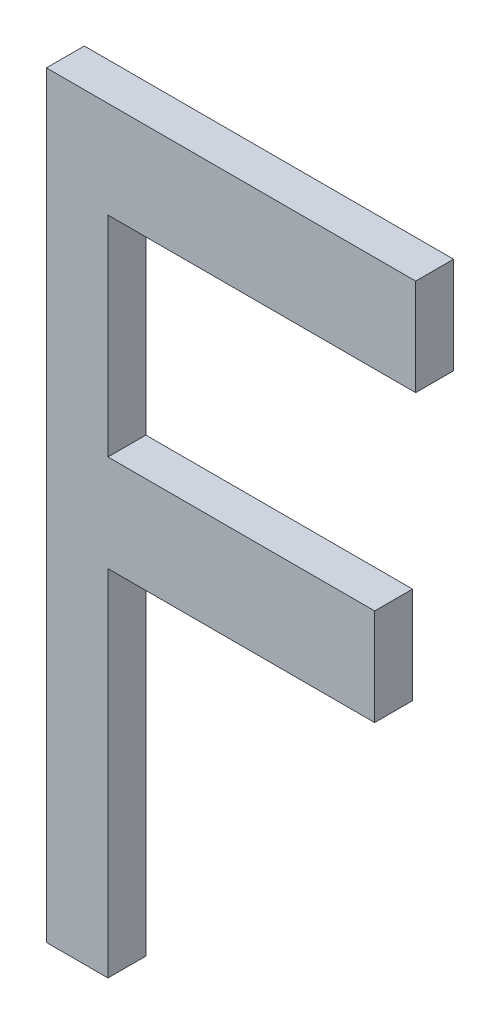
ISO-10303-21;
HEADER;
FILE_DESCRIPTION(('STEP AP214'),'2;1');
FILE_NAME('part.step','',(''),(''),'','','');
FILE_SCHEMA(('AUTOMOTIVE_DESIGN { 1 0 10303 214 1 1 1 1 }'));
ENDSEC;
DATA;
#1=APPLICATION_CONTEXT('core data for automotive mechanical design processes');
#2=APPLICATION_PROTOCOL_DEFINITION('international standard','automotive_design',2000,#1);
#3=PRODUCT_CONTEXT('',#1,'mechanical');
#4=PRODUCT('Part','Part','',(#3));
#5=PRODUCT_RELATED_PRODUCT_CATEGORY('part','',(#4));
#6=PRODUCT_DEFINITION_FORMATION('','',#4);
#7=PRODUCT_DEFINITION_CONTEXT('part definition',#1,'design');
#8=PRODUCT_DEFINITION('design','',#6,#7);
#9=PRODUCT_DEFINITION_SHAPE('','',#8);
#10=(LENGTH_UNIT() NAMED_UNIT(*) SI_UNIT(.MILLI.,.METRE.));
#11=(NAMED_UNIT(*) PLANE_ANGLE_UNIT() SI_UNIT($,.RADIAN.));
#12=(NAMED_UNIT(*) SI_UNIT($,.STERADIAN.) SOLID_ANGLE_UNIT());
#13=UNCERTAINTY_MEASURE_WITH_UNIT(LENGTH_MEASURE(1.E-05),#10,'distance_accuracy_value','');
#14=(GEOMETRIC_REPRESENTATION_CONTEXT(3) GLOBAL_UNCERTAINTY_ASSIGNED_CONTEXT((#13)) GLOBAL_UNIT_ASSIGNED_CONTEXT((#10,
#11,#12)) REPRESENTATION_CONTEXT('',''));
#15=CARTESIAN_POINT('',(0.,0.,0.));
#16=DIRECTION('',(0.,0.,1.));
#17=DIRECTION('',(1.,0.,0.));
#18=AXIS2_PLACEMENT_3D('',#15,#16,#17);
#19=CARTESIAN_POINT('',(71.1648311134674,28.2906710184784,5.9));
#20=DIRECTION('',(0.,0.,1.));
#21=DIRECTION('',(1.,0.,0.));
#22=AXIS2_PLACEMENT_3D('',#19,#20,#21);
#23=PLANE('',#22);
#24=DIRECTION('',(1.,0.,0.));
#25=VECTOR('',#24,1.);
#26=CARTESIAN_POINT('',(71.1648311134674,30.2906710184783,5.9));
#27=LINE('',#26,#25);
#28=CARTESIAN_POINT('',(72.1398311134674,30.2906710184783,5.9));
#29=VERTEX_POINT('',#28);
#30=CARTESIAN_POINT('',(71.1648311134674,30.2906710184783,5.9));
#31=VERTEX_POINT('',#30);
#32=EDGE_CURVE('E126',#29,#31,#27,.F.);
#33=ORIENTED_EDGE('',*,*,#32,.F.);
#34=DIRECTION('',(0.,1.,0.));
#35=VECTOR('',#34,1.);
#36=CARTESIAN_POINT('',(72.1398311134674,28.2906710184784,5.9));
#37=LINE('',#36,#35);
#38=CARTESIAN_POINT('',(72.1398311134674,30.0353518999784,5.9));
#39=VERTEX_POINT('',#38);
#40=EDGE_CURVE('E124',#39,#29,#37,.T.);
#41=ORIENTED_EDGE('',*,*,#40,.F.);
#42=DIRECTION('',(1.,0.,0.));
#43=VECTOR('',#42,1.);
#44=CARTESIAN_POINT('',(71.1648311134674,30.0353518999784,5.9));
#45=LINE('',#44,#43);
#46=CARTESIAN_POINT('',(71.3273311134674,30.0353518999784,5.9));
#47=VERTEX_POINT('',#46);
#48=EDGE_CURVE('E122',#47,#39,#45,.T.);
#49=ORIENTED_EDGE('',*,*,#48,.F.);
#50=DIRECTION('',(0.,1.,0.));
#51=VECTOR('',#50,1.);
#52=CARTESIAN_POINT('',(71.3273311134674,28.2906710184784,5.9));
#53=LINE('',#52,#51);
#54=CARTESIAN_POINT('',(71.3273311134674,29.4821603573583,5.9));
#55=VERTEX_POINT('',#54);
#56=EDGE_CURVE('E120',#55,#47,#53,.T.);
#57=ORIENTED_EDGE('',*,*,#56,.F.);
#58=DIRECTION('',(1.,0.,0.));
#59=VECTOR('',#58,1.);
#60=CARTESIAN_POINT('',(71.1648311134674,29.4821603573584,5.9));
#61=LINE('',#60,#59);
#62=CARTESIAN_POINT('',(72.0314978059574,29.4821603573584,5.9));
#63=VERTEX_POINT('',#62);
#64=EDGE_CURVE('E118',#63,#55,#61,.F.);
#65=ORIENTED_EDGE('',*,*,#64,.F.);
#66=DIRECTION('',(0.,1.,0.));
#67=VECTOR('',#66,1.);
#68=CARTESIAN_POINT('',(72.0314978059574,28.2906710184784,5.9));
#69=LINE('',#68,#67);
#70=CARTESIAN_POINT('',(72.0314978059574,29.2268412388584,5.9));
#71=VERTEX_POINT('',#70);
#72=EDGE_CURVE('E114',#71,#63,#69,.T.);
#73=ORIENTED_EDGE('',*,*,#72,.F.);
#74=DIRECTION('',(1.,0.,0.));
#75=VECTOR('',#74,1.);
#76=CARTESIAN_POINT('',(71.1648311134674,29.2268412388584,5.9));
#77=LINE('',#76,#75);
#78=CARTESIAN_POINT('',(71.3273311134674,29.2268412388584,5.9));
#79=VERTEX_POINT('',#78);
#80=EDGE_CURVE('E113',#79,#71,#77,.T.);
#81=ORIENTED_EDGE('',*,*,#80,.F.);
#82=DIRECTION('',(0.,1.,0.));
#83=VECTOR('',#82,1.);
#84=CARTESIAN_POINT('',(71.3273311134674,28.2906710184784,5.9));
#85=LINE('',#84,#83);
#86=CARTESIAN_POINT('',(71.3273311134674,28.2906710184784,5.9));
#87=VERTEX_POINT('',#86);
#88=EDGE_CURVE('E91',#87,#79,#85,.T.);
#89=ORIENTED_EDGE('',*,*,#88,.F.);
#90=DIRECTION('',(1.,0.,0.));
#91=VECTOR('',#90,1.);
#92=CARTESIAN_POINT('',(71.1648311134674,28.2906710184784,5.9));
#93=LINE('',#92,#91);
#94=CARTESIAN_POINT('',(71.1648311134674,28.2906710184784,5.9));
#95=VERTEX_POINT('',#94);
#96=EDGE_CURVE('E20',#95,#87,#93,.T.);
#97=ORIENTED_EDGE('',*,*,#96,.F.);
#98=DIRECTION('',(0.,1.,0.));
#99=VECTOR('',#98,1.);
#100=CARTESIAN_POINT('',(71.1648311134674,30.2906710184784,5.9));
#101=LINE('',#100,#99);
#102=EDGE_CURVE('E128',#95,#31,#101,.T.);
#103=ORIENTED_EDGE('',*,*,#102,.T.);
#104=EDGE_LOOP('',(#33,#41,#49,#57,#65,#73,#81,#89,#97,#103));
#105=FACE_BOUND('',#104,.T.);
#106=ADVANCED_FACE('F17',(#105),#23,.F.);
#107=CARTESIAN_POINT('',(71.1648311134674,30.2906710184784,6.));
#108=DIRECTION('',(1.,0.,0.));
#109=DIRECTION('',(0.,0.,-1.));
#110=AXIS2_PLACEMENT_3D('',#107,#108,#109);
#111=PLANE('',#110);
#112=DIRECTION('',(0.,0.,1.));
#113=VECTOR('',#112,1.);
#114=CARTESIAN_POINT('',(71.1648311134674,28.2906710184784,6.));
#115=LINE('',#114,#113);
#116=CARTESIAN_POINT('',(71.1648311134674,28.2906710184784,6.));
#117=VERTEX_POINT('',#116);
#118=EDGE_CURVE('E100',#95,#117,#115,.T.);
#119=ORIENTED_EDGE('',*,*,#118,.T.);
#120=DIRECTION('',(0.,1.,0.));
#121=VECTOR('',#120,1.);
#122=CARTESIAN_POINT('',(71.1648311134674,28.2906710184784,6.));
#123=LINE('',#122,#121);
#124=CARTESIAN_POINT('',(71.1648311134674,30.2906710184784,6.));
#125=VERTEX_POINT('',#124);
#126=EDGE_CURVE('E146',#125,#117,#123,.F.);
#127=ORIENTED_EDGE('',*,*,#126,.F.);
#128=DIRECTION('',(0.,0.,1.));
#129=VECTOR('',#128,1.);
#130=CARTESIAN_POINT('',(71.1648311134674,30.2906710184783,6.));
#131=LINE('',#130,#129);
#132=EDGE_CURVE('E143',#125,#31,#131,.F.);
#133=ORIENTED_EDGE('',*,*,#132,.T.);
#134=ORIENTED_EDGE('',*,*,#102,.F.);
#135=EDGE_LOOP('',(#119,#127,#133,#134));
#136=FACE_BOUND('',#135,.T.);
#137=ADVANCED_FACE('F181',(#136),#111,.F.);
#138=CARTESIAN_POINT('',(71.1648311134674,28.2906710184784,6.));
#139=DIRECTION('',(0.,1.,0.));
#140=DIRECTION('',(0.,0.,1.));
#141=AXIS2_PLACEMENT_3D('',#138,#139,#140);
#142=PLANE('',#141);
#143=DIRECTION('',(0.,0.,1.));
#144=VECTOR('',#143,1.);
#145=CARTESIAN_POINT('',(71.3273311134674,28.2906710184784,6.));
#146=LINE('',#145,#144);
#147=CARTESIAN_POINT('',(71.3273311134674,28.2906710184784,6.));
#148=VERTEX_POINT('',#147);
#149=EDGE_CURVE('E98',#87,#148,#146,.T.);
#150=ORIENTED_EDGE('',*,*,#149,.T.);
#151=DIRECTION('',(1.,0.,0.));
#152=VECTOR('',#151,1.);
#153=CARTESIAN_POINT('',(71.1648311134674,28.2906710184784,6.));
#154=LINE('',#153,#152);
#155=EDGE_CURVE('E149',#117,#148,#154,.T.);
#156=ORIENTED_EDGE('',*,*,#155,.F.);
#157=ORIENTED_EDGE('',*,*,#118,.F.);
#158=ORIENTED_EDGE('',*,*,#96,.T.);
#159=EDGE_LOOP('',(#150,#156,#157,#158));
#160=FACE_BOUND('',#159,.T.);
#161=ADVANCED_FACE('F96',(#160),#142,.F.);
#162=CARTESIAN_POINT('',(71.3273311134674,28.2906710184784,6.));
#163=DIRECTION('',(-1.,0.,0.));
#164=DIRECTION('',(0.,0.,1.));
#165=AXIS2_PLACEMENT_3D('',#162,#163,#164);
#166=PLANE('',#165);
#167=DIRECTION('',(0.,0.,1.));
#168=VECTOR('',#167,1.);
#169=CARTESIAN_POINT('',(71.3273311134674,29.2268412388584,6.));
#170=LINE('',#169,#168);
#171=CARTESIAN_POINT('',(71.3273311134674,29.2268412388584,6.));
#172=VERTEX_POINT('',#171);
#173=EDGE_CURVE('E108',#79,#172,#170,.T.);
#174=ORIENTED_EDGE('',*,*,#173,.T.);
#175=DIRECTION('',(0.,1.,0.));
#176=VECTOR('',#175,1.);
#177=CARTESIAN_POINT('',(71.3273311134674,28.2906710184784,6.));
#178=LINE('',#177,#176);
#179=EDGE_CURVE('E106',#148,#172,#178,.T.);
#180=ORIENTED_EDGE('',*,*,#179,.F.);
#181=ORIENTED_EDGE('',*,*,#149,.F.);
#182=ORIENTED_EDGE('',*,*,#88,.T.);
#183=EDGE_LOOP('',(#174,#180,#181,#182));
#184=FACE_BOUND('',#183,.T.);
#185=ADVANCED_FACE('F104',(#184),#166,.F.);
#186=CARTESIAN_POINT('',(71.3273311134674,29.2268412388584,6.));
#187=DIRECTION('',(0.,1.,0.));
#188=DIRECTION('',(0.,0.,1.));
#189=AXIS2_PLACEMENT_3D('',#186,#187,#188);
#190=PLANE('',#189);
#191=DIRECTION('',(0.,0.,1.));
#192=VECTOR('',#191,1.);
#193=CARTESIAN_POINT('',(72.0314978059574,29.2268412388584,6.));
#194=LINE('',#193,#192);
#195=CARTESIAN_POINT('',(72.0314978059574,29.2268412388584,6.));
#196=VERTEX_POINT('',#195);
#197=EDGE_CURVE('E132',#71,#196,#194,.T.);
#198=ORIENTED_EDGE('',*,*,#197,.T.);
#199=DIRECTION('',(1.,0.,0.));
#200=VECTOR('',#199,1.);
#201=CARTESIAN_POINT('',(71.1648311134674,29.2268412388584,6.));
#202=LINE('',#201,#200);
#203=EDGE_CURVE('E152',#172,#196,#202,.T.);
#204=ORIENTED_EDGE('',*,*,#203,.F.);
#205=ORIENTED_EDGE('',*,*,#173,.F.);
#206=ORIENTED_EDGE('',*,*,#80,.T.);
#207=EDGE_LOOP('',(#198,#204,#205,#206));
#208=FACE_BOUND('',#207,.T.);
#209=ADVANCED_FACE('F185',(#208),#190,.F.);
#210=CARTESIAN_POINT('',(72.0314978059574,29.2268412388584,6.));
#211=DIRECTION('',(-1.,0.,0.));
#212=DIRECTION('',(0.,0.,1.));
#213=AXIS2_PLACEMENT_3D('',#210,#211,#212);
#214=PLANE('',#213);
#215=DIRECTION('',(0.,0.,-1.));
#216=VECTOR('',#215,1.);
#217=CARTESIAN_POINT('',(72.0314978059574,29.4821603573583,6.));
#218=LINE('',#217,#216);
#219=CARTESIAN_POINT('',(72.0314978059574,29.4821603573584,6.));
#220=VERTEX_POINT('',#219);
#221=EDGE_CURVE('E134',#63,#220,#218,.F.);
#222=ORIENTED_EDGE('',*,*,#221,.T.);
#223=DIRECTION('',(0.,1.,0.));
#224=VECTOR('',#223,1.);
#225=CARTESIAN_POINT('',(72.0314978059574,28.2906710184784,6.));
#226=LINE('',#225,#224);
#227=EDGE_CURVE('E155',#196,#220,#226,.T.);
#228=ORIENTED_EDGE('',*,*,#227,.F.);
#229=ORIENTED_EDGE('',*,*,#197,.F.);
#230=ORIENTED_EDGE('',*,*,#72,.T.);
#231=EDGE_LOOP('',(#222,#228,#229,#230));
#232=FACE_BOUND('',#231,.T.);
#233=ADVANCED_FACE('F188',(#232),#214,.F.);
#234=CARTESIAN_POINT('',(72.0314978059574,29.4821603573583,6.));
#235=DIRECTION('',(0.,-1.,0.));
#236=DIRECTION('',(0.,0.,-1.));
#237=AXIS2_PLACEMENT_3D('',#234,#235,#236);
#238=PLANE('',#237);
#239=DIRECTION('',(0.,0.,1.));
#240=VECTOR('',#239,1.);
#241=CARTESIAN_POINT('',(71.3273311134674,29.4821603573583,6.));
#242=LINE('',#241,#240);
#243=CARTESIAN_POINT('',(71.3273311134674,29.4821603573583,6.));
#244=VERTEX_POINT('',#243);
#245=EDGE_CURVE('E136',#55,#244,#242,.T.);
#246=ORIENTED_EDGE('',*,*,#245,.T.);
#247=DIRECTION('',(1.,0.,0.));
#248=VECTOR('',#247,1.);
#249=CARTESIAN_POINT('',(71.1648311134674,29.4821603573584,6.));
#250=LINE('',#249,#248);
#251=EDGE_CURVE('E158',#220,#244,#250,.F.);
#252=ORIENTED_EDGE('',*,*,#251,.F.);
#253=ORIENTED_EDGE('',*,*,#221,.F.);
#254=ORIENTED_EDGE('',*,*,#64,.T.);
#255=EDGE_LOOP('',(#246,#252,#253,#254));
#256=FACE_BOUND('',#255,.T.);
#257=ADVANCED_FACE('F193',(#256),#238,.F.);
#258=CARTESIAN_POINT('',(71.3273311134674,29.4821603573583,6.));
#259=DIRECTION('',(-1.,0.,0.));
#260=DIRECTION('',(0.,0.,1.));
#261=AXIS2_PLACEMENT_3D('',#258,#259,#260);
#262=PLANE('',#261);
#263=DIRECTION('',(0.,0.,1.));
#264=VECTOR('',#263,1.);
#265=CARTESIAN_POINT('',(71.3273311134674,30.0353518999784,6.));
#266=LINE('',#265,#264);
#267=CARTESIAN_POINT('',(71.3273311134674,30.0353518999784,6.));
#268=VERTEX_POINT('',#267);
#269=EDGE_CURVE('E138',#47,#268,#266,.T.);
#270=ORIENTED_EDGE('',*,*,#269,.T.);
#271=DIRECTION('',(0.,1.,0.));
#272=VECTOR('',#271,1.);
#273=CARTESIAN_POINT('',(71.3273311134674,28.2906710184784,6.));
#274=LINE('',#273,#272);
#275=EDGE_CURVE('E161',#244,#268,#274,.T.);
#276=ORIENTED_EDGE('',*,*,#275,.F.);
#277=ORIENTED_EDGE('',*,*,#245,.F.);
#278=ORIENTED_EDGE('',*,*,#56,.T.);
#279=EDGE_LOOP('',(#270,#276,#277,#278));
#280=FACE_BOUND('',#279,.T.);
#281=ADVANCED_FACE('F197',(#280),#262,.F.);
#282=CARTESIAN_POINT('',(71.3273311134674,30.0353518999784,6.));
#283=DIRECTION('',(0.,1.,0.));
#284=DIRECTION('',(0.,0.,1.));
#285=AXIS2_PLACEMENT_3D('',#282,#283,#284);
#286=PLANE('',#285);
#287=DIRECTION('',(0.,0.,1.));
#288=VECTOR('',#287,1.);
#289=CARTESIAN_POINT('',(72.1398311134674,30.0353518999784,6.));
#290=LINE('',#289,#288);
#291=CARTESIAN_POINT('',(72.1398311134674,30.0353518999784,6.));
#292=VERTEX_POINT('',#291);
#293=EDGE_CURVE('E140',#39,#292,#290,.T.);
#294=ORIENTED_EDGE('',*,*,#293,.T.);
#295=DIRECTION('',(1.,0.,0.));
#296=VECTOR('',#295,1.);
#297=CARTESIAN_POINT('',(71.1648311134674,30.0353518999784,6.));
#298=LINE('',#297,#296);
#299=EDGE_CURVE('E164',#268,#292,#298,.T.);
#300=ORIENTED_EDGE('',*,*,#299,.F.);
#301=ORIENTED_EDGE('',*,*,#269,.F.);
#302=ORIENTED_EDGE('',*,*,#48,.T.);
#303=EDGE_LOOP('',(#294,#300,#301,#302));
#304=FACE_BOUND('',#303,.T.);
#305=ADVANCED_FACE('F199',(#304),#286,.F.);
#306=CARTESIAN_POINT('',(72.1398311134674,30.0353518999784,6.));
#307=DIRECTION('',(-1.,0.,0.));
#308=DIRECTION('',(0.,0.,1.));
#309=AXIS2_PLACEMENT_3D('',#306,#307,#308);
#310=PLANE('',#309);
#311=DIRECTION('',(0.,0.,1.));
#312=VECTOR('',#311,1.);
#313=CARTESIAN_POINT('',(72.1398311134674,30.2906710184783,6.));
#314=LINE('',#313,#312);
#315=CARTESIAN_POINT('',(72.1398311134674,30.2906710184783,6.));
#316=VERTEX_POINT('',#315);
#317=EDGE_CURVE('E35',#29,#316,#314,.T.);
#318=ORIENTED_EDGE('',*,*,#317,.T.);
#319=DIRECTION('',(0.,1.,0.));
#320=VECTOR('',#319,1.);
#321=CARTESIAN_POINT('',(72.1398311134674,28.2906710184784,6.));
#322=LINE('',#321,#320);
#323=EDGE_CURVE('E26',#292,#316,#322,.T.);
#324=ORIENTED_EDGE('',*,*,#323,.F.);
#325=ORIENTED_EDGE('',*,*,#293,.F.);
#326=ORIENTED_EDGE('',*,*,#40,.T.);
#327=EDGE_LOOP('',(#318,#324,#325,#326));
#328=FACE_BOUND('',#327,.T.);
#329=ADVANCED_FACE('F172',(#328),#310,.F.);
#330=CARTESIAN_POINT('',(72.1398311134674,30.2906710184783,6.));
#331=DIRECTION('',(0.,-1.,0.));
#332=DIRECTION('',(1.,0.,0.));
#333=AXIS2_PLACEMENT_3D('',#330,#331,#332);
#334=PLANE('',#333);
#335=ORIENTED_EDGE('',*,*,#132,.F.);
#336=DIRECTION('',(1.,0.,0.));
#337=VECTOR('',#336,1.);
#338=CARTESIAN_POINT('',(71.1648311134674,30.2906710184783,6.));
#339=LINE('',#338,#337);
#340=EDGE_CURVE('E11',#316,#125,#339,.F.);
#341=ORIENTED_EDGE('',*,*,#340,.F.);
#342=ORIENTED_EDGE('',*,*,#317,.F.);
#343=ORIENTED_EDGE('',*,*,#32,.T.);
#344=EDGE_LOOP('',(#335,#341,#342,#343));
#345=FACE_BOUND('',#344,.T.);
#346=ADVANCED_FACE('F179',(#345),#334,.F.);
#347=CARTESIAN_POINT('',(71.1648311134674,28.2906710184784,6.));
#348=DIRECTION('',(0.,0.,1.));
#349=DIRECTION('',(1.,0.,0.));
#350=AXIS2_PLACEMENT_3D('',#347,#348,#349);
#351=PLANE('',#350);
#352=ORIENTED_EDGE('',*,*,#323,.T.);
#353=ORIENTED_EDGE('',*,*,#340,.T.);
#354=ORIENTED_EDGE('',*,*,#126,.T.);
#355=ORIENTED_EDGE('',*,*,#155,.T.);
#356=ORIENTED_EDGE('',*,*,#179,.T.);
#357=ORIENTED_EDGE('',*,*,#203,.T.);
#358=ORIENTED_EDGE('',*,*,#227,.T.);
#359=ORIENTED_EDGE('',*,*,#251,.T.);
#360=ORIENTED_EDGE('',*,*,#275,.T.);
#361=ORIENTED_EDGE('',*,*,#299,.T.);
#362=EDGE_LOOP('',(#352,#353,#354,#355,#356,#357,#358,#359,#360,#361));
#363=FACE_BOUND('',#362,.T.);
#364=ADVANCED_FACE('F169',(#363),#351,.T.);
#365=CLOSED_SHELL('',(#106,#137,#161,#185,#209,#233,#257,#281,#305,#329,#346,#364));
#366=MANIFOLD_SOLID_BREP('B1',#365);
#367=ADVANCED_BREP_SHAPE_REPRESENTATION('',(#18,#366),#14);
#368=SHAPE_DEFINITION_REPRESENTATION(#9,#367);
ENDSEC;
END-ISO-10303-21;
